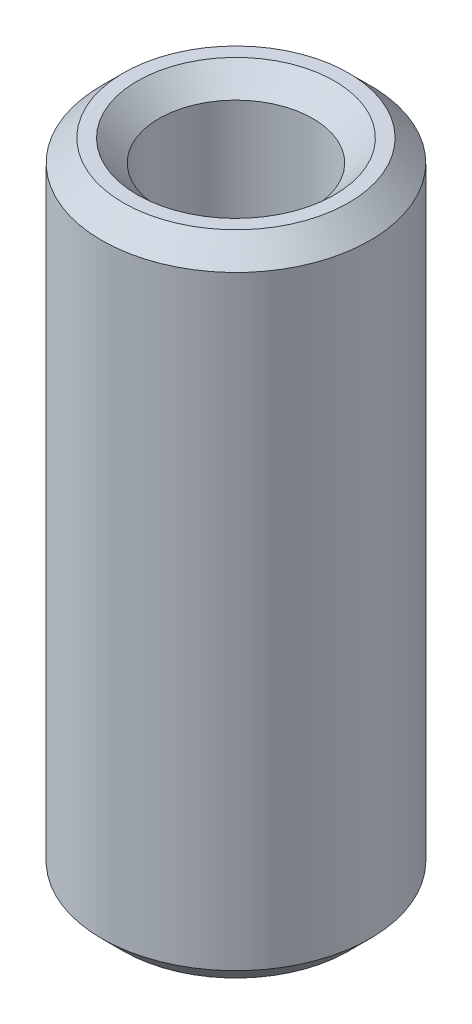
ISO-10303-21;
HEADER;
FILE_DESCRIPTION(('STEP AP214'),'2;1');
FILE_NAME('part.step','',(''),(''),'','','');
FILE_SCHEMA(('AUTOMOTIVE_DESIGN { 1 0 10303 214 1 1 1 1 }'));
ENDSEC;
DATA;
#1=APPLICATION_CONTEXT('core data for automotive mechanical design processes');
#2=APPLICATION_PROTOCOL_DEFINITION('international standard','automotive_design',2000,#1);
#3=PRODUCT_CONTEXT('',#1,'mechanical');
#4=PRODUCT('Part','Part','',(#3));
#5=PRODUCT_RELATED_PRODUCT_CATEGORY('part','',(#4));
#6=PRODUCT_DEFINITION_FORMATION('','',#4);
#7=PRODUCT_DEFINITION_CONTEXT('part definition',#1,'design');
#8=PRODUCT_DEFINITION('design','',#6,#7);
#9=PRODUCT_DEFINITION_SHAPE('','',#8);
#10=(LENGTH_UNIT() NAMED_UNIT(*) SI_UNIT(.MILLI.,.METRE.));
#11=(NAMED_UNIT(*) PLANE_ANGLE_UNIT() SI_UNIT($,.RADIAN.));
#12=(NAMED_UNIT(*) SI_UNIT($,.STERADIAN.) SOLID_ANGLE_UNIT());
#13=UNCERTAINTY_MEASURE_WITH_UNIT(LENGTH_MEASURE(1.E-05),#10,'distance_accuracy_value','');
#14=(GEOMETRIC_REPRESENTATION_CONTEXT(3) GLOBAL_UNCERTAINTY_ASSIGNED_CONTEXT((#13)) GLOBAL_UNIT_ASSIGNED_CONTEXT((#10,
#11,#12)) REPRESENTATION_CONTEXT('',''));
#15=CARTESIAN_POINT('',(0.,0.,0.));
#16=DIRECTION('',(0.,0.,1.));
#17=DIRECTION('',(1.,0.,0.));
#18=AXIS2_PLACEMENT_3D('',#15,#16,#17);
#19=CARTESIAN_POINT('',(0.,36.2068838985313,0.));
#20=DIRECTION('',(0.,-1.,0.));
#21=DIRECTION('',(0.,0.,-1.));
#22=AXIS2_PLACEMENT_3D('',#19,#20,#21);
#23=CYLINDRICAL_SURFACE('',#22,7.5);
#24=CARTESIAN_POINT('',(0.,1.21064700861209,0.));
#25=DIRECTION('',(0.,1.,0.));
#26=DIRECTION('',(0.,0.,1.));
#27=AXIS2_PLACEMENT_3D('',#24,#25,#26);
#28=CIRCLE('',#27,7.5);
#29=CARTESIAN_POINT('',(0.,1.21064700861209,7.5));
#30=VERTEX_POINT('',#29);
#31=EDGE_CURVE('E10',#30,#30,#28,.T.);
#32=ORIENTED_EDGE('',*,*,#31,.T.);
#33=EDGE_LOOP('',(#32));
#34=FACE_BOUND('',#33,.T.);
#35=CARTESIAN_POINT('',(0.,34.9962368899192,0.));
#36=DIRECTION('',(0.,1.,0.));
#37=DIRECTION('',(0.,0.,1.));
#38=AXIS2_PLACEMENT_3D('',#35,#36,#37);
#39=CIRCLE('',#38,7.5);
#40=CARTESIAN_POINT('',(0.,34.9962368899192,7.5));
#41=VERTEX_POINT('',#40);
#42=EDGE_CURVE('E50',#41,#41,#39,.F.);
#43=ORIENTED_EDGE('',*,*,#42,.T.);
#44=EDGE_LOOP('',(#43));
#45=FACE_BOUND('',#44,.T.);
#46=ADVANCED_FACE('F39',(#34,#45),#23,.T.);
#47=CARTESIAN_POINT('',(0.,36.2068838985313,0.));
#48=DIRECTION('',(0.,1.,0.));
#49=DIRECTION('',(0.,0.,1.));
#50=AXIS2_PLACEMENT_3D('',#47,#48,#49);
#51=PLANE('',#50);
#52=CARTESIAN_POINT('',(0.,36.2068838985313,0.));
#53=DIRECTION('',(0.,1.,0.));
#54=DIRECTION('',(0.,0.,1.));
#55=AXIS2_PLACEMENT_3D('',#52,#53,#54);
#56=CIRCLE('',#55,5.50976018155444);
#57=CARTESIAN_POINT('',(0.,36.2068838985313,5.50976018155444));
#58=VERTEX_POINT('',#57);
#59=EDGE_CURVE('E58',#58,#58,#56,.F.);
#60=ORIENTED_EDGE('',*,*,#59,.T.);
#61=EDGE_LOOP('',(#60));
#62=FACE_BOUND('',#61,.T.);
#63=CARTESIAN_POINT('',(0.,36.2068838985313,0.));
#64=DIRECTION('',(0.,1.,0.));
#65=DIRECTION('',(0.,0.,1.));
#66=AXIS2_PLACEMENT_3D('',#63,#64,#65);
#67=CIRCLE('',#66,6.2893529913879);
#68=CARTESIAN_POINT('',(0.,36.2068838985313,6.2893529913879));
#69=VERTEX_POINT('',#68);
#70=EDGE_CURVE('E61',#69,#69,#67,.T.);
#71=ORIENTED_EDGE('',*,*,#70,.T.);
#72=EDGE_LOOP('',(#71));
#73=FACE_BOUND('',#72,.T.);
#74=ADVANCED_FACE('F88',(#62,#73),#51,.T.);
#75=CARTESIAN_POINT('',(0.,0.,0.));
#76=DIRECTION('',(0.,1.,0.));
#77=DIRECTION('',(0.,0.,1.));
#78=AXIS2_PLACEMENT_3D('',#75,#76,#77);
#79=PLANE('',#78);
#80=CARTESIAN_POINT('',(0.,0.,0.));
#81=DIRECTION('',(0.,1.,0.));
#82=DIRECTION('',(0.,0.,1.));
#83=AXIS2_PLACEMENT_3D('',#80,#81,#82);
#84=CIRCLE('',#83,5.50976018155443);
#85=CARTESIAN_POINT('',(0.,0.,5.50976018155443));
#86=VERTEX_POINT('',#85);
#87=EDGE_CURVE('E51',#86,#86,#84,.T.);
#88=ORIENTED_EDGE('',*,*,#87,.T.);
#89=EDGE_LOOP('',(#88));
#90=FACE_BOUND('',#89,.T.);
#91=CARTESIAN_POINT('',(0.,0.,0.));
#92=DIRECTION('',(0.,1.,0.));
#93=DIRECTION('',(0.,0.,1.));
#94=AXIS2_PLACEMENT_3D('',#91,#92,#93);
#95=CIRCLE('',#94,6.28935299138791);
#96=CARTESIAN_POINT('',(0.,0.,6.28935299138791));
#97=VERTEX_POINT('',#96);
#98=EDGE_CURVE('E54',#97,#97,#95,.F.);
#99=ORIENTED_EDGE('',*,*,#98,.T.);
#100=EDGE_LOOP('',(#99));
#101=FACE_BOUND('',#100,.T.);
#102=ADVANCED_FACE('F83',(#90,#101),#79,.F.);
#103=CARTESIAN_POINT('',(0.,36.2068838985313,0.));
#104=DIRECTION('',(0.,-1.,0.));
#105=DIRECTION('',(0.,0.,-1.));
#106=AXIS2_PLACEMENT_3D('',#103,#104,#105);
#107=CYLINDRICAL_SURFACE('',#106,4.29911317294234);
#108=CARTESIAN_POINT('',(0.,34.9962368899192,0.));
#109=DIRECTION('',(0.,1.,0.));
#110=DIRECTION('',(0.,0.,1.));
#111=AXIS2_PLACEMENT_3D('',#108,#109,#110);
#112=CIRCLE('',#111,4.29911317294234);
#113=CARTESIAN_POINT('',(0.,34.9962368899192,4.29911317294234));
#114=VERTEX_POINT('',#113);
#115=EDGE_CURVE('E67',#114,#114,#112,.T.);
#116=ORIENTED_EDGE('',*,*,#115,.T.);
#117=EDGE_LOOP('',(#116));
#118=FACE_BOUND('',#117,.T.);
#119=CARTESIAN_POINT('',(0.,1.2106470086121,0.));
#120=DIRECTION('',(0.,1.,0.));
#121=DIRECTION('',(0.,0.,1.));
#122=AXIS2_PLACEMENT_3D('',#119,#120,#121);
#123=CIRCLE('',#122,4.29911317294234);
#124=CARTESIAN_POINT('',(0.,1.2106470086121,4.29911317294234));
#125=VERTEX_POINT('',#124);
#126=EDGE_CURVE('E69',#125,#125,#123,.F.);
#127=ORIENTED_EDGE('',*,*,#126,.T.);
#128=EDGE_LOOP('',(#127));
#129=FACE_BOUND('',#128,.T.);
#130=ADVANCED_FACE('F71',(#118,#129),#107,.F.);
#131=CARTESIAN_POINT('',(0.,34.9962368899192,0.));
#132=DIRECTION('',(0.,1.,0.));
#133=DIRECTION('',(0.,0.,1.));
#134=AXIS2_PLACEMENT_3D('',#131,#132,#133);
#135=CONICAL_SURFACE('',#134,4.29911317294234,0.785398163397455);
#136=ORIENTED_EDGE('',*,*,#59,.F.);
#137=EDGE_LOOP('',(#136));
#138=FACE_BOUND('',#137,.T.);
#139=ORIENTED_EDGE('',*,*,#115,.F.);
#140=EDGE_LOOP('',(#139));
#141=FACE_BOUND('',#140,.T.);
#142=ADVANCED_FACE('F77',(#138,#141),#135,.F.);
#143=CARTESIAN_POINT('',(0.,0.,0.));
#144=DIRECTION('',(0.,-1.,0.));
#145=DIRECTION('',(0.,0.,-1.));
#146=AXIS2_PLACEMENT_3D('',#143,#144,#145);
#147=CONICAL_SURFACE('',#146,5.50976018155443,0.785398163397445);
#148=ORIENTED_EDGE('',*,*,#126,.F.);
#149=EDGE_LOOP('',(#148));
#150=FACE_BOUND('',#149,.T.);
#151=ORIENTED_EDGE('',*,*,#87,.F.);
#152=EDGE_LOOP('',(#151));
#153=FACE_BOUND('',#152,.T.);
#154=ADVANCED_FACE('F73',(#150,#153),#147,.F.);
#155=CARTESIAN_POINT('',(0.,1.21064700861209,0.));
#156=DIRECTION('',(0.,1.,0.));
#157=DIRECTION('',(0.,0.,1.));
#158=AXIS2_PLACEMENT_3D('',#155,#156,#157);
#159=CONICAL_SURFACE('',#158,7.5,0.785398163397451);
#160=ORIENTED_EDGE('',*,*,#98,.F.);
#161=EDGE_LOOP('',(#160));
#162=FACE_BOUND('',#161,.T.);
#163=ORIENTED_EDGE('',*,*,#31,.F.);
#164=EDGE_LOOP('',(#163));
#165=FACE_BOUND('',#164,.T.);
#166=ADVANCED_FACE('F76',(#162,#165),#159,.T.);
#167=CARTESIAN_POINT('',(0.,36.2068838985313,0.));
#168=DIRECTION('',(0.,-1.,0.));
#169=DIRECTION('',(0.,0.,-1.));
#170=AXIS2_PLACEMENT_3D('',#167,#168,#169);
#171=CONICAL_SURFACE('',#170,6.2893529913879,0.785398163397443);
#172=ORIENTED_EDGE('',*,*,#42,.F.);
#173=EDGE_LOOP('',(#172));
#174=FACE_BOUND('',#173,.T.);
#175=ORIENTED_EDGE('',*,*,#70,.F.);
#176=EDGE_LOOP('',(#175));
#177=FACE_BOUND('',#176,.T.);
#178=ADVANCED_FACE('F45',(#174,#177),#171,.T.);
#179=CLOSED_SHELL('',(#46,#74,#102,#130,#142,#154,#166,#178));
#180=MANIFOLD_SOLID_BREP('B2',#179);
#181=ADVANCED_BREP_SHAPE_REPRESENTATION('',(#18,#180),#14);
#182=SHAPE_DEFINITION_REPRESENTATION(#9,#181);
ENDSEC;
END-ISO-10303-21;
